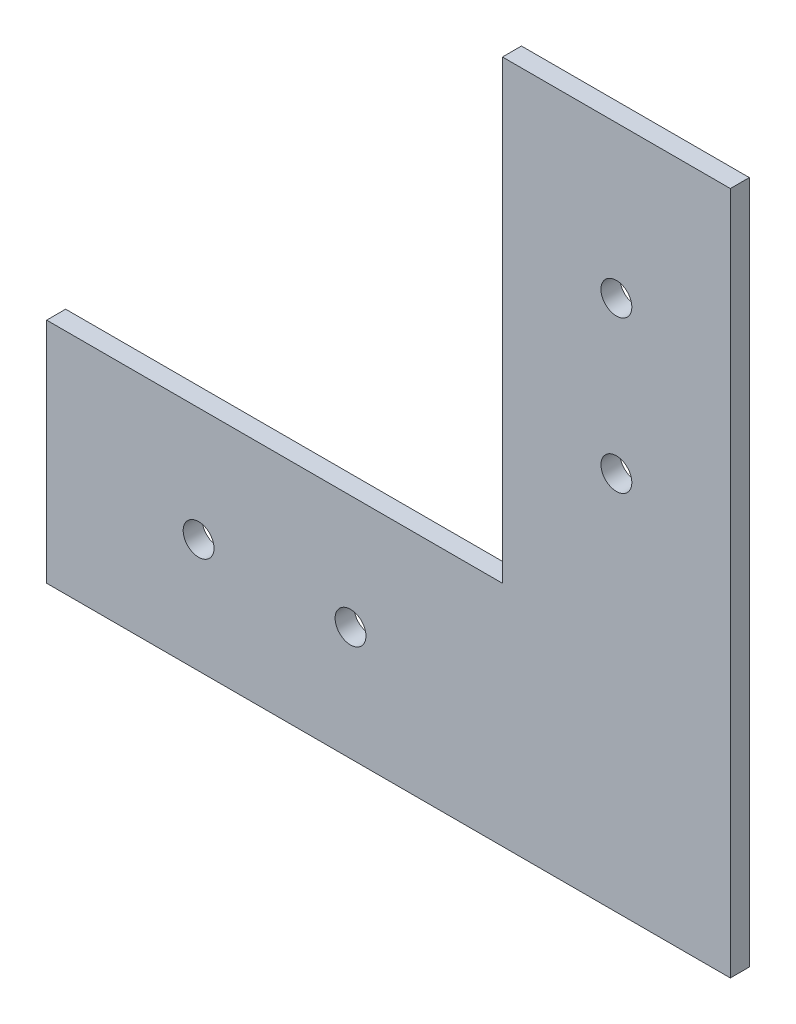
ISO-10303-21;
HEADER;
FILE_DESCRIPTION(('STEP AP214'),'2;1');
FILE_NAME('part.step','',(''),(''),'','','');
FILE_SCHEMA(('AUTOMOTIVE_DESIGN { 1 0 10303 214 1 1 1 1 }'));
ENDSEC;
DATA;
#1=APPLICATION_CONTEXT('core data for automotive mechanical design processes');
#2=APPLICATION_PROTOCOL_DEFINITION('international standard','automotive_design',2000,#1);
#3=PRODUCT_CONTEXT('',#1,'mechanical');
#4=PRODUCT('Part','Part','',(#3));
#5=PRODUCT_RELATED_PRODUCT_CATEGORY('part','',(#4));
#6=PRODUCT_DEFINITION_FORMATION('','',#4);
#7=PRODUCT_DEFINITION_CONTEXT('part definition',#1,'design');
#8=PRODUCT_DEFINITION('design','',#6,#7);
#9=PRODUCT_DEFINITION_SHAPE('','',#8);
#10=(LENGTH_UNIT() NAMED_UNIT(*) SI_UNIT(.MILLI.,.METRE.));
#11=(NAMED_UNIT(*) PLANE_ANGLE_UNIT() SI_UNIT($,.RADIAN.));
#12=(NAMED_UNIT(*) SI_UNIT($,.STERADIAN.) SOLID_ANGLE_UNIT());
#13=UNCERTAINTY_MEASURE_WITH_UNIT(LENGTH_MEASURE(1.E-05),#10,'distance_accuracy_value','');
#14=(GEOMETRIC_REPRESENTATION_CONTEXT(3) GLOBAL_UNCERTAINTY_ASSIGNED_CONTEXT((#13)) GLOBAL_UNIT_ASSIGNED_CONTEXT((#10,
#11,#12)) REPRESENTATION_CONTEXT('',''));
#15=CARTESIAN_POINT('',(0.,0.,0.));
#16=DIRECTION('',(0.,0.,1.));
#17=DIRECTION('',(1.,0.,0.));
#18=AXIS2_PLACEMENT_3D('',#15,#16,#17);
#19=CARTESIAN_POINT('',(44.2367978429737,-24.7135135135135,3.175));
#20=DIRECTION('',(1.,0.,0.));
#21=DIRECTION('',(0.,0.,-1.));
#22=AXIS2_PLACEMENT_3D('',#19,#20,#21);
#23=PLANE('',#22);
#24=DIRECTION('',(0.,-1.,0.));
#25=VECTOR('',#24,1.);
#26=CARTESIAN_POINT('',(44.2367978429737,-24.7135135135135,0.));
#27=LINE('',#26,#25);
#28=CARTESIAN_POINT('',(44.2367978429737,51.4864864864865,0.));
#29=VERTEX_POINT('',#28);
#30=CARTESIAN_POINT('',(44.2367978429737,-24.7135135135135,0.));
#31=VERTEX_POINT('',#30);
#32=EDGE_CURVE('E128',#29,#31,#27,.T.);
#33=ORIENTED_EDGE('',*,*,#32,.T.);
#34=DIRECTION('',(0.,0.,-1.));
#35=VECTOR('',#34,1.);
#36=CARTESIAN_POINT('',(44.2367978429737,-24.7135135135135,3.175));
#37=LINE('',#36,#35);
#38=CARTESIAN_POINT('',(44.2367978429737,-24.7135135135135,3.175));
#39=VERTEX_POINT('',#38);
#40=EDGE_CURVE('E11',#39,#31,#37,.T.);
#41=ORIENTED_EDGE('',*,*,#40,.F.);
#42=DIRECTION('',(0.,-1.,0.));
#43=VECTOR('',#42,1.);
#44=CARTESIAN_POINT('',(44.2367978429737,-24.7135135135135,3.175));
#45=LINE('',#44,#43);
#46=CARTESIAN_POINT('',(44.2367978429737,51.4864864864865,3.175));
#47=VERTEX_POINT('',#46);
#48=EDGE_CURVE('E145',#47,#39,#45,.T.);
#49=ORIENTED_EDGE('',*,*,#48,.F.);
#50=DIRECTION('',(0.,0.,-1.));
#51=VECTOR('',#50,1.);
#52=CARTESIAN_POINT('',(44.2367978429737,51.4864864864865,3.175));
#53=LINE('',#52,#51);
#54=EDGE_CURVE('E124',#47,#29,#53,.T.);
#55=ORIENTED_EDGE('',*,*,#54,.T.);
#56=EDGE_LOOP('',(#33,#41,#49,#55));
#57=FACE_BOUND('',#56,.T.);
#58=ADVANCED_FACE('F39',(#57),#23,.F.);
#59=CARTESIAN_POINT('',(-31.9632021570263,-24.7135135135135,3.175));
#60=DIRECTION('',(0.,-1.,0.));
#61=DIRECTION('',(1.,0.,0.));
#62=AXIS2_PLACEMENT_3D('',#59,#60,#61);
#63=PLANE('',#62);
#64=DIRECTION('',(-1.,0.,0.));
#65=VECTOR('',#64,1.);
#66=CARTESIAN_POINT('',(-31.9632021570263,-24.7135135135135,0.));
#67=LINE('',#66,#65);
#68=CARTESIAN_POINT('',(-31.9632021570263,-24.7135135135135,0.));
#69=VERTEX_POINT('',#68);
#70=EDGE_CURVE('E132',#31,#69,#67,.T.);
#71=ORIENTED_EDGE('',*,*,#70,.T.);
#72=DIRECTION('',(0.,0.,-1.));
#73=VECTOR('',#72,1.);
#74=CARTESIAN_POINT('',(-31.9632021570263,-24.7135135135135,3.175));
#75=LINE('',#74,#73);
#76=CARTESIAN_POINT('',(-31.9632021570263,-24.7135135135135,3.175));
#77=VERTEX_POINT('',#76);
#78=EDGE_CURVE('E48',#77,#69,#75,.T.);
#79=ORIENTED_EDGE('',*,*,#78,.F.);
#80=DIRECTION('',(-1.,0.,0.));
#81=VECTOR('',#80,1.);
#82=CARTESIAN_POINT('',(-31.9632021570263,-24.7135135135135,3.175));
#83=LINE('',#82,#81);
#84=EDGE_CURVE('E93',#39,#77,#83,.T.);
#85=ORIENTED_EDGE('',*,*,#84,.F.);
#86=ORIENTED_EDGE('',*,*,#40,.T.);
#87=EDGE_LOOP('',(#71,#79,#85,#86));
#88=FACE_BOUND('',#87,.T.);
#89=ADVANCED_FACE('F174',(#88),#63,.F.);
#90=CARTESIAN_POINT('',(-31.9632021570263,-62.8135135135135,3.175));
#91=DIRECTION('',(1.,0.,0.));
#92=DIRECTION('',(0.,0.,-1.));
#93=AXIS2_PLACEMENT_3D('',#90,#91,#92);
#94=PLANE('',#93);
#95=DIRECTION('',(0.,-1.,0.));
#96=VECTOR('',#95,1.);
#97=CARTESIAN_POINT('',(-31.9632021570263,-62.8135135135135,0.));
#98=LINE('',#97,#96);
#99=CARTESIAN_POINT('',(-31.9632021570263,-62.8135135135135,0.));
#100=VERTEX_POINT('',#99);
#101=EDGE_CURVE('E136',#69,#100,#98,.T.);
#102=ORIENTED_EDGE('',*,*,#101,.T.);
#103=DIRECTION('',(0.,0.,-1.));
#104=VECTOR('',#103,1.);
#105=CARTESIAN_POINT('',(-31.9632021570263,-62.8135135135135,3.175));
#106=LINE('',#105,#104);
#107=CARTESIAN_POINT('',(-31.9632021570263,-62.8135135135135,3.175));
#108=VERTEX_POINT('',#107);
#109=EDGE_CURVE('E117',#108,#100,#106,.T.);
#110=ORIENTED_EDGE('',*,*,#109,.F.);
#111=DIRECTION('',(0.,-1.,0.));
#112=VECTOR('',#111,1.);
#113=CARTESIAN_POINT('',(-31.9632021570263,-62.8135135135135,3.175));
#114=LINE('',#113,#112);
#115=EDGE_CURVE('E106',#77,#108,#114,.T.);
#116=ORIENTED_EDGE('',*,*,#115,.F.);
#117=ORIENTED_EDGE('',*,*,#78,.T.);
#118=EDGE_LOOP('',(#102,#110,#116,#117));
#119=FACE_BOUND('',#118,.T.);
#120=ADVANCED_FACE('F155',(#119),#94,.F.);
#121=CARTESIAN_POINT('',(82.3367978429737,-62.8135135135135,3.175));
#122=DIRECTION('',(0.,1.,0.));
#123=DIRECTION('',(-1.,0.,0.));
#124=AXIS2_PLACEMENT_3D('',#121,#122,#123);
#125=PLANE('',#124);
#126=DIRECTION('',(1.,0.,0.));
#127=VECTOR('',#126,1.);
#128=CARTESIAN_POINT('',(82.3367978429737,-62.8135135135135,0.));
#129=LINE('',#128,#127);
#130=CARTESIAN_POINT('',(82.3367978429737,-62.8135135135135,0.));
#131=VERTEX_POINT('',#130);
#132=EDGE_CURVE('E115',#100,#131,#129,.T.);
#133=ORIENTED_EDGE('',*,*,#132,.T.);
#134=DIRECTION('',(0.,0.,-1.));
#135=VECTOR('',#134,1.);
#136=CARTESIAN_POINT('',(82.3367978429737,-62.8135135135135,3.175));
#137=LINE('',#136,#135);
#138=CARTESIAN_POINT('',(82.3367978429737,-62.8135135135135,3.175));
#139=VERTEX_POINT('',#138);
#140=EDGE_CURVE('E112',#139,#131,#137,.T.);
#141=ORIENTED_EDGE('',*,*,#140,.F.);
#142=DIRECTION('',(1.,0.,0.));
#143=VECTOR('',#142,1.);
#144=CARTESIAN_POINT('',(82.3367978429737,-62.8135135135135,3.175));
#145=LINE('',#144,#143);
#146=EDGE_CURVE('E100',#108,#139,#145,.T.);
#147=ORIENTED_EDGE('',*,*,#146,.F.);
#148=ORIENTED_EDGE('',*,*,#109,.T.);
#149=EDGE_LOOP('',(#133,#141,#147,#148));
#150=FACE_BOUND('',#149,.T.);
#151=ADVANCED_FACE('F113',(#150),#125,.F.);
#152=CARTESIAN_POINT('',(82.3367978429737,51.4864864864865,3.175));
#153=DIRECTION('',(-1.,0.,0.));
#154=DIRECTION('',(0.,-1.,0.));
#155=AXIS2_PLACEMENT_3D('',#152,#153,#154);
#156=PLANE('',#155);
#157=DIRECTION('',(0.,1.,0.));
#158=VECTOR('',#157,1.);
#159=CARTESIAN_POINT('',(82.3367978429737,51.4864864864865,0.));
#160=LINE('',#159,#158);
#161=CARTESIAN_POINT('',(82.3367978429737,51.4864864864865,0.));
#162=VERTEX_POINT('',#161);
#163=EDGE_CURVE('E79',#131,#162,#160,.T.);
#164=ORIENTED_EDGE('',*,*,#163,.T.);
#165=DIRECTION('',(0.,0.,-1.));
#166=VECTOR('',#165,1.);
#167=CARTESIAN_POINT('',(82.3367978429737,51.4864864864865,3.175));
#168=LINE('',#167,#166);
#169=CARTESIAN_POINT('',(82.3367978429737,51.4864864864865,3.175));
#170=VERTEX_POINT('',#169);
#171=EDGE_CURVE('E118',#170,#162,#168,.T.);
#172=ORIENTED_EDGE('',*,*,#171,.F.);
#173=DIRECTION('',(0.,1.,0.));
#174=VECTOR('',#173,1.);
#175=CARTESIAN_POINT('',(82.3367978429737,51.4864864864865,3.175));
#176=LINE('',#175,#174);
#177=EDGE_CURVE('E104',#139,#170,#176,.T.);
#178=ORIENTED_EDGE('',*,*,#177,.F.);
#179=ORIENTED_EDGE('',*,*,#140,.T.);
#180=EDGE_LOOP('',(#164,#172,#178,#179));
#181=FACE_BOUND('',#180,.T.);
#182=ADVANCED_FACE('F120',(#181),#156,.F.);
#183=CARTESIAN_POINT('',(44.2367978429737,51.4864864864865,3.175));
#184=DIRECTION('',(0.,-1.,0.));
#185=DIRECTION('',(0.,0.,-1.));
#186=AXIS2_PLACEMENT_3D('',#183,#184,#185);
#187=PLANE('',#186);
#188=DIRECTION('',(-1.,0.,0.));
#189=VECTOR('',#188,1.);
#190=CARTESIAN_POINT('',(44.2367978429737,51.4864864864865,0.));
#191=LINE('',#190,#189);
#192=EDGE_CURVE('E85',#162,#29,#191,.T.);
#193=ORIENTED_EDGE('',*,*,#192,.T.);
#194=ORIENTED_EDGE('',*,*,#54,.F.);
#195=DIRECTION('',(-1.,0.,0.));
#196=VECTOR('',#195,1.);
#197=CARTESIAN_POINT('',(44.2367978429737,51.4864864864865,3.175));
#198=LINE('',#197,#196);
#199=EDGE_CURVE('E56',#170,#47,#198,.T.);
#200=ORIENTED_EDGE('',*,*,#199,.F.);
#201=ORIENTED_EDGE('',*,*,#171,.T.);
#202=EDGE_LOOP('',(#193,#194,#200,#201));
#203=FACE_BOUND('',#202,.T.);
#204=ADVANCED_FACE('F162',(#203),#187,.F.);
#205=CARTESIAN_POINT('',(0.,0.,3.175));
#206=DIRECTION('',(0.,0.,-1.));
#207=DIRECTION('',(-1.,0.,0.));
#208=AXIS2_PLACEMENT_3D('',#205,#206,#207);
#209=PLANE('',#208);
#210=CARTESIAN_POINT('',(63.2867978429737,26.0864864864865,3.175));
#211=DIRECTION('',(0.,0.,1.));
#212=DIRECTION('',(1.,0.,0.));
#213=AXIS2_PLACEMENT_3D('',#210,#211,#212);
#214=CIRCLE('',#213,2.5796875);
#215=CARTESIAN_POINT('',(65.8664853429737,26.0864864864865,3.175));
#216=VERTEX_POINT('',#215);
#217=EDGE_CURVE('E259',#216,#216,#214,.T.);
#218=ORIENTED_EDGE('',*,*,#217,.F.);
#219=EDGE_LOOP('',(#218));
#220=FACE_BOUND('',#219,.T.);
#221=CARTESIAN_POINT('',(18.8367978429737,-43.7635135135135,3.175));
#222=DIRECTION('',(0.,0.,1.));
#223=DIRECTION('',(1.,0.,0.));
#224=AXIS2_PLACEMENT_3D('',#221,#222,#223);
#225=CIRCLE('',#224,2.5796875);
#226=CARTESIAN_POINT('',(21.4164853429737,-43.7635135135135,3.175));
#227=VERTEX_POINT('',#226);
#228=EDGE_CURVE('E275',#227,#227,#225,.T.);
#229=ORIENTED_EDGE('',*,*,#228,.F.);
#230=EDGE_LOOP('',(#229));
#231=FACE_BOUND('',#230,.T.);
#232=CARTESIAN_POINT('',(-6.56320215702632,-43.7635135135135,3.175));
#233=DIRECTION('',(0.,0.,1.));
#234=DIRECTION('',(1.,0.,0.));
#235=AXIS2_PLACEMENT_3D('',#232,#233,#234);
#236=CIRCLE('',#235,2.5796875);
#237=CARTESIAN_POINT('',(-3.98351465702632,-43.7635135135135,3.175));
#238=VERTEX_POINT('',#237);
#239=EDGE_CURVE('E274',#238,#238,#236,.T.);
#240=ORIENTED_EDGE('',*,*,#239,.F.);
#241=EDGE_LOOP('',(#240));
#242=FACE_BOUND('',#241,.T.);
#243=CARTESIAN_POINT('',(63.2867978429737,0.686486486486505,3.175));
#244=DIRECTION('',(0.,0.,1.));
#245=DIRECTION('',(1.,0.,0.));
#246=AXIS2_PLACEMENT_3D('',#243,#244,#245);
#247=CIRCLE('',#246,2.5796875);
#248=CARTESIAN_POINT('',(65.8664853429737,0.686486486486505,3.175));
#249=VERTEX_POINT('',#248);
#250=EDGE_CURVE('E267',#249,#249,#247,.T.);
#251=ORIENTED_EDGE('',*,*,#250,.F.);
#252=EDGE_LOOP('',(#251));
#253=FACE_BOUND('',#252,.T.);
#254=ORIENTED_EDGE('',*,*,#48,.T.);
#255=ORIENTED_EDGE('',*,*,#84,.T.);
#256=ORIENTED_EDGE('',*,*,#115,.T.);
#257=ORIENTED_EDGE('',*,*,#146,.T.);
#258=ORIENTED_EDGE('',*,*,#177,.T.);
#259=ORIENTED_EDGE('',*,*,#199,.T.);
#260=EDGE_LOOP('',(#254,#255,#256,#257,#258,#259));
#261=FACE_BOUND('',#260,.T.);
#262=ADVANCED_FACE('F102',(#220,#231,#242,#253,#261),#209,.F.);
#263=CARTESIAN_POINT('',(0.,0.,0.));
#264=DIRECTION('',(0.,0.,-1.));
#265=DIRECTION('',(-1.,0.,0.));
#266=AXIS2_PLACEMENT_3D('',#263,#264,#265);
#267=PLANE('',#266);
#268=CARTESIAN_POINT('',(63.2867978429737,26.0864864864865,0.));
#269=DIRECTION('',(0.,0.,1.));
#270=DIRECTION('',(1.,0.,0.));
#271=AXIS2_PLACEMENT_3D('',#268,#269,#270);
#272=CIRCLE('',#271,2.5796875);
#273=CARTESIAN_POINT('',(65.8664853429737,26.0864864864865,0.));
#274=VERTEX_POINT('',#273);
#275=EDGE_CURVE('E133',#274,#274,#272,.T.);
#276=ORIENTED_EDGE('',*,*,#275,.T.);
#277=EDGE_LOOP('',(#276));
#278=FACE_BOUND('',#277,.T.);
#279=CARTESIAN_POINT('',(18.8367978429737,-43.7635135135135,0.));
#280=DIRECTION('',(0.,0.,1.));
#281=DIRECTION('',(1.,0.,0.));
#282=AXIS2_PLACEMENT_3D('',#279,#280,#281);
#283=CIRCLE('',#282,2.5796875);
#284=CARTESIAN_POINT('',(21.4164853429737,-43.7635135135135,0.));
#285=VERTEX_POINT('',#284);
#286=EDGE_CURVE('E270',#285,#285,#283,.T.);
#287=ORIENTED_EDGE('',*,*,#286,.T.);
#288=EDGE_LOOP('',(#287));
#289=FACE_BOUND('',#288,.T.);
#290=CARTESIAN_POINT('',(-6.56320215702632,-43.7635135135135,0.));
#291=DIRECTION('',(0.,0.,1.));
#292=DIRECTION('',(1.,0.,0.));
#293=AXIS2_PLACEMENT_3D('',#290,#291,#292);
#294=CIRCLE('',#293,2.5796875);
#295=CARTESIAN_POINT('',(-3.98351465702632,-43.7635135135135,0.));
#296=VERTEX_POINT('',#295);
#297=EDGE_CURVE('E282',#296,#296,#294,.T.);
#298=ORIENTED_EDGE('',*,*,#297,.T.);
#299=EDGE_LOOP('',(#298));
#300=FACE_BOUND('',#299,.T.);
#301=CARTESIAN_POINT('',(63.2867978429737,0.686486486486505,0.));
#302=DIRECTION('',(0.,0.,1.));
#303=DIRECTION('',(1.,0.,0.));
#304=AXIS2_PLACEMENT_3D('',#301,#302,#303);
#305=CIRCLE('',#304,2.5796875);
#306=CARTESIAN_POINT('',(65.8664853429737,0.686486486486505,0.));
#307=VERTEX_POINT('',#306);
#308=EDGE_CURVE('E261',#307,#307,#305,.T.);
#309=ORIENTED_EDGE('',*,*,#308,.T.);
#310=EDGE_LOOP('',(#309));
#311=FACE_BOUND('',#310,.T.);
#312=ORIENTED_EDGE('',*,*,#32,.F.);
#313=ORIENTED_EDGE('',*,*,#192,.F.);
#314=ORIENTED_EDGE('',*,*,#163,.F.);
#315=ORIENTED_EDGE('',*,*,#132,.F.);
#316=ORIENTED_EDGE('',*,*,#101,.F.);
#317=ORIENTED_EDGE('',*,*,#70,.F.);
#318=EDGE_LOOP('',(#312,#313,#314,#315,#316,#317));
#319=FACE_BOUND('',#318,.T.);
#320=ADVANCED_FACE('F158',(#278,#289,#300,#311,#319),#267,.T.);
#321=CARTESIAN_POINT('',(63.2867978429737,0.686486486486505,0.));
#322=DIRECTION('',(0.,0.,1.));
#323=DIRECTION('',(1.,0.,0.));
#324=AXIS2_PLACEMENT_3D('',#321,#322,#323);
#325=CYLINDRICAL_SURFACE('',#324,2.5796875);
#326=ORIENTED_EDGE('',*,*,#308,.F.);
#327=EDGE_LOOP('',(#326));
#328=FACE_BOUND('',#327,.T.);
#329=ORIENTED_EDGE('',*,*,#250,.T.);
#330=EDGE_LOOP('',(#329));
#331=FACE_BOUND('',#330,.T.);
#332=ADVANCED_FACE('F211',(#328,#331),#325,.F.);
#333=CARTESIAN_POINT('',(-6.56320215702632,-43.7635135135135,0.));
#334=DIRECTION('',(0.,0.,1.));
#335=DIRECTION('',(1.,0.,0.));
#336=AXIS2_PLACEMENT_3D('',#333,#334,#335);
#337=CYLINDRICAL_SURFACE('',#336,2.5796875);
#338=ORIENTED_EDGE('',*,*,#297,.F.);
#339=EDGE_LOOP('',(#338));
#340=FACE_BOUND('',#339,.T.);
#341=ORIENTED_EDGE('',*,*,#239,.T.);
#342=EDGE_LOOP('',(#341));
#343=FACE_BOUND('',#342,.T.);
#344=ADVANCED_FACE('F220',(#340,#343),#337,.F.);
#345=CARTESIAN_POINT('',(18.8367978429737,-43.7635135135135,0.));
#346=DIRECTION('',(0.,0.,1.));
#347=DIRECTION('',(1.,0.,0.));
#348=AXIS2_PLACEMENT_3D('',#345,#346,#347);
#349=CYLINDRICAL_SURFACE('',#348,2.5796875);
#350=ORIENTED_EDGE('',*,*,#286,.F.);
#351=EDGE_LOOP('',(#350));
#352=FACE_BOUND('',#351,.T.);
#353=ORIENTED_EDGE('',*,*,#228,.T.);
#354=EDGE_LOOP('',(#353));
#355=FACE_BOUND('',#354,.T.);
#356=ADVANCED_FACE('F230',(#352,#355),#349,.F.);
#357=CARTESIAN_POINT('',(63.2867978429737,26.0864864864865,0.));
#358=DIRECTION('',(0.,0.,1.));
#359=DIRECTION('',(1.,0.,0.));
#360=AXIS2_PLACEMENT_3D('',#357,#358,#359);
#361=CYLINDRICAL_SURFACE('',#360,2.5796875);
#362=ORIENTED_EDGE('',*,*,#275,.F.);
#363=EDGE_LOOP('',(#362));
#364=FACE_BOUND('',#363,.T.);
#365=ORIENTED_EDGE('',*,*,#217,.T.);
#366=EDGE_LOOP('',(#365));
#367=FACE_BOUND('',#366,.T.);
#368=ADVANCED_FACE('F240',(#364,#367),#361,.F.);
#369=CLOSED_SHELL('',(#58,#89,#120,#151,#182,#204,#262,#320,#332,#344,#356,#368));
#370=MANIFOLD_SOLID_BREP('B2',#369);
#371=ADVANCED_BREP_SHAPE_REPRESENTATION('',(#18,#370),#14);
#372=SHAPE_DEFINITION_REPRESENTATION(#9,#371);
ENDSEC;
END-ISO-10303-21;
